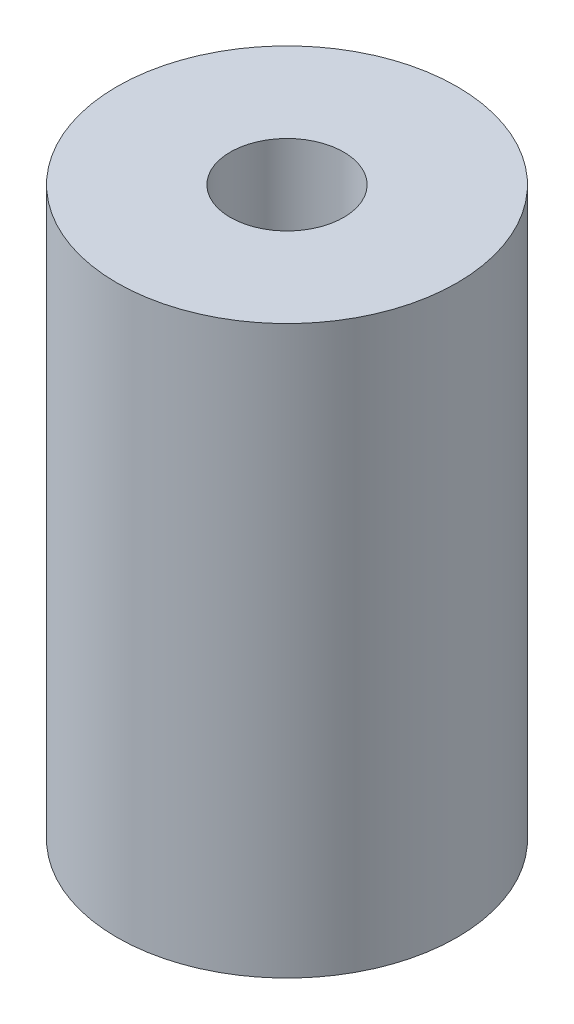
ISO-10303-21;
HEADER;
FILE_DESCRIPTION(('STEP AP214'),'2;1');
FILE_NAME('part.step','',(''),(''),'','','');
FILE_SCHEMA(('AUTOMOTIVE_DESIGN { 1 0 10303 214 1 1 1 1 }'));
ENDSEC;
DATA;
#1=APPLICATION_CONTEXT('core data for automotive mechanical design processes');
#2=APPLICATION_PROTOCOL_DEFINITION('international standard','automotive_design',2000,#1);
#3=PRODUCT_CONTEXT('',#1,'mechanical');
#4=PRODUCT('Part','Part','',(#3));
#5=PRODUCT_RELATED_PRODUCT_CATEGORY('part','',(#4));
#6=PRODUCT_DEFINITION_FORMATION('','',#4);
#7=PRODUCT_DEFINITION_CONTEXT('part definition',#1,'design');
#8=PRODUCT_DEFINITION('design','',#6,#7);
#9=PRODUCT_DEFINITION_SHAPE('','',#8);
#10=(LENGTH_UNIT() NAMED_UNIT(*) SI_UNIT(.MILLI.,.METRE.));
#11=(NAMED_UNIT(*) PLANE_ANGLE_UNIT() SI_UNIT($,.RADIAN.));
#12=(NAMED_UNIT(*) SI_UNIT($,.STERADIAN.) SOLID_ANGLE_UNIT());
#13=UNCERTAINTY_MEASURE_WITH_UNIT(LENGTH_MEASURE(1.E-05),#10,'distance_accuracy_value','');
#14=(GEOMETRIC_REPRESENTATION_CONTEXT(3) GLOBAL_UNCERTAINTY_ASSIGNED_CONTEXT((#13)) GLOBAL_UNIT_ASSIGNED_CONTEXT((#10,
#11,#12)) REPRESENTATION_CONTEXT('',''));
#15=CARTESIAN_POINT('',(0.,0.,0.));
#16=DIRECTION('',(0.,0.,1.));
#17=DIRECTION('',(1.,0.,0.));
#18=AXIS2_PLACEMENT_3D('',#15,#16,#17);
#19=CARTESIAN_POINT('',(0.,31.75,0.));
#20=DIRECTION('',(0.,1.,0.));
#21=DIRECTION('',(0.,0.,1.));
#22=AXIS2_PLACEMENT_3D('',#19,#20,#21);
#23=PLANE('',#22);
#24=CARTESIAN_POINT('',(0.,31.75,0.));
#25=DIRECTION('',(0.,1.,0.));
#26=DIRECTION('',(0.,0.,1.));
#27=AXIS2_PLACEMENT_3D('',#24,#25,#26);
#28=CIRCLE('',#27,9.525);
#29=CARTESIAN_POINT('',(0.,31.75,9.525));
#30=VERTEX_POINT('',#29);
#31=EDGE_CURVE('E10',#30,#30,#28,.T.);
#32=ORIENTED_EDGE('',*,*,#31,.T.);
#33=EDGE_LOOP('',(#32));
#34=FACE_BOUND('',#33,.T.);
#35=CARTESIAN_POINT('',(0.,31.75,0.));
#36=DIRECTION('',(0.,1.,0.));
#37=DIRECTION('',(0.,0.,1.));
#38=AXIS2_PLACEMENT_3D('',#35,#36,#37);
#39=CIRCLE('',#38,3.175);
#40=CARTESIAN_POINT('',(0.,31.75,3.175));
#41=VERTEX_POINT('',#40);
#42=EDGE_CURVE('E41',#41,#41,#39,.T.);
#43=ORIENTED_EDGE('',*,*,#42,.F.);
#44=EDGE_LOOP('',(#43));
#45=FACE_BOUND('',#44,.T.);
#46=ADVANCED_FACE('F30',(#34,#45),#23,.T.);
#47=CARTESIAN_POINT('',(0.,0.,0.));
#48=DIRECTION('',(0.,1.,0.));
#49=DIRECTION('',(0.,0.,1.));
#50=AXIS2_PLACEMENT_3D('',#47,#48,#49);
#51=PLANE('',#50);
#52=CARTESIAN_POINT('',(0.,0.,0.));
#53=DIRECTION('',(0.,1.,0.));
#54=DIRECTION('',(0.,0.,1.));
#55=AXIS2_PLACEMENT_3D('',#52,#53,#54);
#56=CIRCLE('',#55,9.525);
#57=CARTESIAN_POINT('',(0.,0.,9.525));
#58=VERTEX_POINT('',#57);
#59=EDGE_CURVE('E34',#58,#58,#56,.T.);
#60=ORIENTED_EDGE('',*,*,#59,.F.);
#61=EDGE_LOOP('',(#60));
#62=FACE_BOUND('',#61,.T.);
#63=CARTESIAN_POINT('',(0.,0.,0.));
#64=DIRECTION('',(0.,1.,0.));
#65=DIRECTION('',(0.,0.,1.));
#66=AXIS2_PLACEMENT_3D('',#63,#64,#65);
#67=CIRCLE('',#66,3.175);
#68=CARTESIAN_POINT('',(0.,0.,3.175));
#69=VERTEX_POINT('',#68);
#70=EDGE_CURVE('E43',#69,#69,#67,.T.);
#71=ORIENTED_EDGE('',*,*,#70,.T.);
#72=EDGE_LOOP('',(#71));
#73=FACE_BOUND('',#72,.T.);
#74=ADVANCED_FACE('F53',(#62,#73),#51,.F.);
#75=CARTESIAN_POINT('',(0.,31.75,0.));
#76=DIRECTION('',(0.,-1.,0.));
#77=DIRECTION('',(0.,0.,-1.));
#78=AXIS2_PLACEMENT_3D('',#75,#76,#77);
#79=CYLINDRICAL_SURFACE('',#78,9.525);
#80=ORIENTED_EDGE('',*,*,#31,.F.);
#81=EDGE_LOOP('',(#80));
#82=FACE_BOUND('',#81,.T.);
#83=ORIENTED_EDGE('',*,*,#59,.T.);
#84=EDGE_LOOP('',(#83));
#85=FACE_BOUND('',#84,.T.);
#86=ADVANCED_FACE('F32',(#82,#85),#79,.T.);
#87=CARTESIAN_POINT('',(0.,31.75,0.));
#88=DIRECTION('',(0.,-1.,0.));
#89=DIRECTION('',(0.,0.,-1.));
#90=AXIS2_PLACEMENT_3D('',#87,#88,#89);
#91=CYLINDRICAL_SURFACE('',#90,3.175);
#92=ORIENTED_EDGE('',*,*,#42,.T.);
#93=EDGE_LOOP('',(#92));
#94=FACE_BOUND('',#93,.T.);
#95=ORIENTED_EDGE('',*,*,#70,.F.);
#96=EDGE_LOOP('',(#95));
#97=FACE_BOUND('',#96,.T.);
#98=ADVANCED_FACE('F49',(#94,#97),#91,.F.);
#99=CLOSED_SHELL('',(#46,#74,#86,#98));
#100=MANIFOLD_SOLID_BREP('B2',#99);
#101=ADVANCED_BREP_SHAPE_REPRESENTATION('',(#18,#100),#14);
#102=SHAPE_DEFINITION_REPRESENTATION(#9,#101);
ENDSEC;
END-ISO-10303-21;
